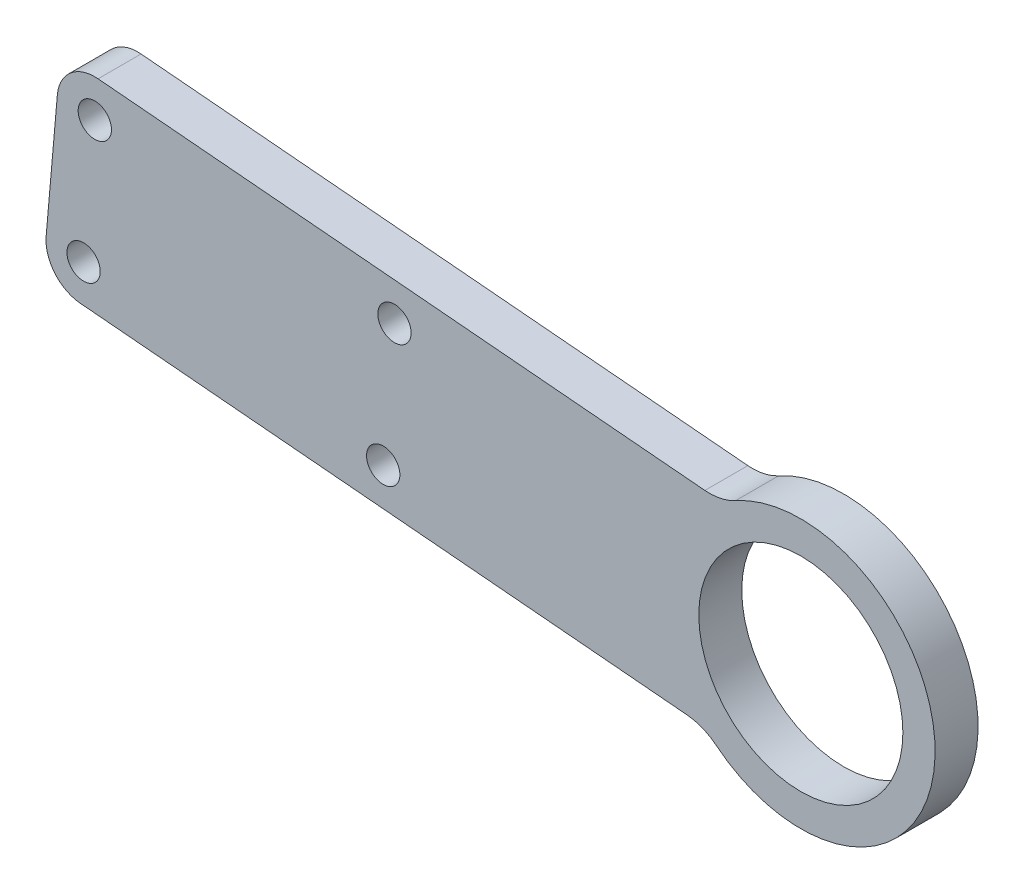
ISO-10303-21;
HEADER;
FILE_DESCRIPTION(('STEP AP214'),'2;1');
FILE_NAME('part.step','',(''),(''),'','','');
FILE_SCHEMA(('AUTOMOTIVE_DESIGN { 1 0 10303 214 1 1 1 1 }'));
ENDSEC;
DATA;
#1=APPLICATION_CONTEXT('core data for automotive mechanical design processes');
#2=APPLICATION_PROTOCOL_DEFINITION('international standard','automotive_design',2000,#1);
#3=PRODUCT_CONTEXT('',#1,'mechanical');
#4=PRODUCT('Part','Part','',(#3));
#5=PRODUCT_RELATED_PRODUCT_CATEGORY('part','',(#4));
#6=PRODUCT_DEFINITION_FORMATION('','',#4);
#7=PRODUCT_DEFINITION_CONTEXT('part definition',#1,'design');
#8=PRODUCT_DEFINITION('design','',#6,#7);
#9=PRODUCT_DEFINITION_SHAPE('','',#8);
#10=(LENGTH_UNIT() NAMED_UNIT(*) SI_UNIT(.MILLI.,.METRE.));
#11=(NAMED_UNIT(*) PLANE_ANGLE_UNIT() SI_UNIT($,.RADIAN.));
#12=(NAMED_UNIT(*) SI_UNIT($,.STERADIAN.) SOLID_ANGLE_UNIT());
#13=UNCERTAINTY_MEASURE_WITH_UNIT(LENGTH_MEASURE(1.E-05),#10,'distance_accuracy_value','');
#14=(GEOMETRIC_REPRESENTATION_CONTEXT(3) GLOBAL_UNCERTAINTY_ASSIGNED_CONTEXT((#13)) GLOBAL_UNIT_ASSIGNED_CONTEXT((#10,
#11,#12)) REPRESENTATION_CONTEXT('',''));
#15=CARTESIAN_POINT('',(0.,0.,0.));
#16=DIRECTION('',(0.,0.,1.));
#17=DIRECTION('',(1.,0.,0.));
#18=AXIS2_PLACEMENT_3D('',#15,#16,#17);
#19=CARTESIAN_POINT('',(0.,0.,2.));
#20=DIRECTION('',(0.,0.,1.));
#21=DIRECTION('',(1.,0.,0.));
#22=AXIS2_PLACEMENT_3D('',#19,#20,#21);
#23=PLANE('',#22);
#24=CARTESIAN_POINT('',(160.,0.,2.));
#25=DIRECTION('',(0.,0.,1.));
#26=DIRECTION('',(1.,0.,0.));
#27=AXIS2_PLACEMENT_3D('',#24,#25,#26);
#28=CIRCLE('',#27,9.50000000000001);
#29=CARTESIAN_POINT('',(169.5,0.,2.));
#30=VERTEX_POINT('',#29);
#31=EDGE_CURVE('E353',#30,#30,#28,.T.);
#32=ORIENTED_EDGE('',*,*,#31,.F.);
#33=EDGE_LOOP('',(#32));
#34=FACE_BOUND('',#33,.T.);
#35=DIRECTION('',(0.996194698091746,-0.0871557427476583,0.));
#36=VECTOR('',#35,1.);
#37=CARTESIAN_POINT('',(11.3715785534696,3.46701349766295,2.));
#38=LINE('',#37,#36);
#39=CARTESIAN_POINT('',(92.9250730207962,-3.66799273915231,2.));
#40=VERTEX_POINT('',#39);
#41=CARTESIAN_POINT('',(149.411345664734,-8.60990124033144,2.));
#42=VERTEX_POINT('',#41);
#43=EDGE_CURVE('E126',#40,#42,#38,.T.);
#44=ORIENTED_EDGE('',*,*,#43,.T.);
#45=CARTESIAN_POINT('',(148.975566950996,-13.5908747307902,2.));
#46=DIRECTION('',(0.,0.,1.));
#47=DIRECTION('',(1.,0.,0.));
#48=AXIS2_PLACEMENT_3D('',#45,#46,#47);
#49=CIRCLE('',#48,5.);
#50=CARTESIAN_POINT('',(152.125404964997,-9.70776766485012,2.));
#51=VERTEX_POINT('',#50);
#52=EDGE_CURVE('E149',#42,#51,#49,.F.);
#53=ORIENTED_EDGE('',*,*,#52,.T.);
#54=CARTESIAN_POINT('',(160.,0.,2.));
#55=DIRECTION('',(0.,0.,1.));
#56=DIRECTION('',(1.,0.,0.));
#57=AXIS2_PLACEMENT_3D('',#54,#55,#56);
#58=CIRCLE('',#57,12.5);
#59=CARTESIAN_POINT('',(153.930773921913,10.9276939384789,2.));
#60=VERTEX_POINT('',#59);
#61=EDGE_CURVE('E164',#51,#60,#58,.T.);
#62=ORIENTED_EDGE('',*,*,#61,.T.);
#63=CARTESIAN_POINT('',(151.503083490678,15.2987715138705,2.));
#64=DIRECTION('',(0.,0.,1.));
#65=DIRECTION('',(1.,0.,0.));
#66=AXIS2_PLACEMENT_3D('',#63,#64,#65);
#67=CIRCLE('',#66,5.);
#68=CARTESIAN_POINT('',(151.06730477694,10.3177980234117,2.));
#69=VERTEX_POINT('',#68);
#70=EDGE_CURVE('E12',#60,#69,#67,.F.);
#71=ORIENTED_EDGE('',*,*,#70,.T.);
#72=DIRECTION('',(-0.996194698091746,0.0871557427476583,0.));
#73=VECTOR('',#72,1.);
#74=CARTESIAN_POINT('',(-1.49619679974456,23.6653748791911,2.));
#75=LINE('',#74,#73);
#76=CARTESIAN_POINT('',(94.5810321330017,15.2597065245909,2.));
#77=VERTEX_POINT('',#76);
#78=EDGE_CURVE('E102',#69,#77,#75,.T.);
#79=ORIENTED_EDGE('',*,*,#78,.T.);
#80=CARTESIAN_POINT('',(94.2759870333849,11.7730250812698,2.));
#81=DIRECTION('',(0.,0.,1.));
#82=DIRECTION('',(1.,0.,0.));
#83=AXIS2_PLACEMENT_3D('',#80,#81,#82);
#84=CIRCLE('',#83,3.5);
#85=CARTESIAN_POINT('',(90.7893055900638,12.0780701808866,2.));
#86=VERTEX_POINT('',#85);
#87=EDGE_CURVE('E97',#77,#86,#84,.T.);
#88=ORIENTED_EDGE('',*,*,#87,.T.);
#89=DIRECTION('',(-0.0871557427476583,-0.996194698091746,0.));
#90=VECTOR('',#89,1.);
#91=CARTESIAN_POINT('',(91.0943506896806,15.5647516242077,2.));
#92=LINE('',#91,#90);
#93=CARTESIAN_POINT('',(89.7434366770919,0.123733803785607,2.));
#94=VERTEX_POINT('',#93);
#95=EDGE_CURVE('E101',#86,#94,#92,.T.);
#96=ORIENTED_EDGE('',*,*,#95,.T.);
#97=CARTESIAN_POINT('',(93.230118120413,-0.181311295831198,2.));
#98=DIRECTION('',(0.,0.,1.));
#99=DIRECTION('',(1.,0.,0.));
#100=AXIS2_PLACEMENT_3D('',#97,#98,#99);
#101=CIRCLE('',#100,3.5);
#102=EDGE_CURVE('E107',#94,#40,#101,.T.);
#103=ORIENTED_EDGE('',*,*,#102,.T.);
#104=EDGE_LOOP('',(#44,#53,#62,#71,#79,#88,#96,#103));
#105=FACE_BOUND('',#104,.T.);
#106=CARTESIAN_POINT('',(93.230118120413,-0.1813112958312,2.));
#107=DIRECTION('',(0.,0.,1.));
#108=DIRECTION('',(1.,0.,0.));
#109=AXIS2_PLACEMENT_3D('',#106,#107,#108);
#110=CIRCLE('',#109,1.54999999999999);
#111=CARTESIAN_POINT('',(94.780118120413,-0.1813112958312,2.));
#112=VERTEX_POINT('',#111);
#113=EDGE_CURVE('E329',#112,#112,#110,.T.);
#114=ORIENTED_EDGE('',*,*,#113,.F.);
#115=EDGE_LOOP('',(#114));
#116=FACE_BOUND('',#115,.T.);
#117=CARTESIAN_POINT('',(122.169438579954,9.33266428433532,2.));
#118=DIRECTION('',(0.,0.,1.));
#119=DIRECTION('',(1.,0.,0.));
#120=AXIS2_PLACEMENT_3D('',#117,#118,#119);
#121=CIRCLE('',#120,1.54999999999999);
#122=CARTESIAN_POINT('',(123.719438579954,9.33266428433532,2.));
#123=VERTEX_POINT('',#122);
#124=EDGE_CURVE('E341',#123,#123,#121,.T.);
#125=ORIENTED_EDGE('',*,*,#124,.F.);
#126=EDGE_LOOP('',(#125));
#127=FACE_BOUND('',#126,.T.);
#128=CARTESIAN_POINT('',(121.123569666982,-2.62167209276563,2.));
#129=DIRECTION('',(0.,0.,1.));
#130=DIRECTION('',(1.,0.,0.));
#131=AXIS2_PLACEMENT_3D('',#128,#129,#130);
#132=CIRCLE('',#131,1.54999999999999);
#133=CARTESIAN_POINT('',(122.673569666982,-2.62167209276563,2.));
#134=VERTEX_POINT('',#133);
#135=EDGE_CURVE('E163',#134,#134,#132,.T.);
#136=ORIENTED_EDGE('',*,*,#135,.F.);
#137=EDGE_LOOP('',(#136));
#138=FACE_BOUND('',#137,.T.);
#139=CARTESIAN_POINT('',(94.2759870333849,11.7730250812698,2.));
#140=DIRECTION('',(0.,0.,1.));
#141=DIRECTION('',(1.,0.,0.));
#142=AXIS2_PLACEMENT_3D('',#139,#140,#141);
#143=CIRCLE('',#142,1.54999999999999);
#144=CARTESIAN_POINT('',(95.8259870333849,11.7730250812698,2.));
#145=VERTEX_POINT('',#144);
#146=EDGE_CURVE('E174',#145,#145,#143,.T.);
#147=ORIENTED_EDGE('',*,*,#146,.F.);
#148=EDGE_LOOP('',(#147));
#149=FACE_BOUND('',#148,.T.);
#150=ADVANCED_FACE('F34',(#34,#105,#116,#127,#138,#149),#23,.T.);
#151=CARTESIAN_POINT('',(0.,0.,-2.));
#152=DIRECTION('',(0.,0.,1.));
#153=DIRECTION('',(1.,0.,0.));
#154=AXIS2_PLACEMENT_3D('',#151,#152,#153);
#155=PLANE('',#154);
#156=CARTESIAN_POINT('',(160.,0.,-2.));
#157=DIRECTION('',(0.,0.,1.));
#158=DIRECTION('',(1.,0.,0.));
#159=AXIS2_PLACEMENT_3D('',#156,#157,#158);
#160=CIRCLE('',#159,9.50000000000001);
#161=CARTESIAN_POINT('',(169.5,0.,-2.));
#162=VERTEX_POINT('',#161);
#163=EDGE_CURVE('E351',#162,#162,#160,.T.);
#164=ORIENTED_EDGE('',*,*,#163,.T.);
#165=EDGE_LOOP('',(#164));
#166=FACE_BOUND('',#165,.T.);
#167=CARTESIAN_POINT('',(93.230118120413,-0.1813112958312,-2.));
#168=DIRECTION('',(0.,0.,1.));
#169=DIRECTION('',(1.,0.,0.));
#170=AXIS2_PLACEMENT_3D('',#167,#168,#169);
#171=CIRCLE('',#170,1.54999999999999);
#172=CARTESIAN_POINT('',(94.780118120413,-0.1813112958312,-2.));
#173=VERTEX_POINT('',#172);
#174=EDGE_CURVE('E327',#173,#173,#171,.T.);
#175=ORIENTED_EDGE('',*,*,#174,.T.);
#176=EDGE_LOOP('',(#175));
#177=FACE_BOUND('',#176,.T.);
#178=CARTESIAN_POINT('',(122.169438579954,9.33266428433532,-2.));
#179=DIRECTION('',(0.,0.,1.));
#180=DIRECTION('',(1.,0.,0.));
#181=AXIS2_PLACEMENT_3D('',#178,#179,#180);
#182=CIRCLE('',#181,1.54999999999999);
#183=CARTESIAN_POINT('',(123.719438579954,9.33266428433532,-2.));
#184=VERTEX_POINT('',#183);
#185=EDGE_CURVE('E334',#184,#184,#182,.T.);
#186=ORIENTED_EDGE('',*,*,#185,.T.);
#187=EDGE_LOOP('',(#186));
#188=FACE_BOUND('',#187,.T.);
#189=CARTESIAN_POINT('',(121.123569666982,-2.62167209276563,-2.));
#190=DIRECTION('',(0.,0.,1.));
#191=DIRECTION('',(1.,0.,0.));
#192=AXIS2_PLACEMENT_3D('',#189,#190,#191);
#193=CIRCLE('',#192,1.54999999999999);
#194=CARTESIAN_POINT('',(122.673569666982,-2.62167209276563,-2.));
#195=VERTEX_POINT('',#194);
#196=EDGE_CURVE('E343',#195,#195,#193,.T.);
#197=ORIENTED_EDGE('',*,*,#196,.T.);
#198=EDGE_LOOP('',(#197));
#199=FACE_BOUND('',#198,.T.);
#200=CARTESIAN_POINT('',(94.2759870333849,11.7730250812698,-2.));
#201=DIRECTION('',(0.,0.,1.));
#202=DIRECTION('',(1.,0.,0.));
#203=AXIS2_PLACEMENT_3D('',#200,#201,#202);
#204=CIRCLE('',#203,1.54999999999999);
#205=CARTESIAN_POINT('',(95.8259870333849,11.7730250812698,-2.));
#206=VERTEX_POINT('',#205);
#207=EDGE_CURVE('E118',#206,#206,#204,.T.);
#208=ORIENTED_EDGE('',*,*,#207,.T.);
#209=EDGE_LOOP('',(#208));
#210=FACE_BOUND('',#209,.T.);
#211=DIRECTION('',(-0.996194698091746,0.0871557427476583,0.));
#212=VECTOR('',#211,1.);
#213=CARTESIAN_POINT('',(-1.49619679974456,23.6653748791911,-2.));
#214=LINE('',#213,#212);
#215=CARTESIAN_POINT('',(151.06730477694,10.3177980234117,-2.));
#216=VERTEX_POINT('',#215);
#217=CARTESIAN_POINT('',(94.5810321330017,15.2597065245909,-2.));
#218=VERTEX_POINT('',#217);
#219=EDGE_CURVE('E129',#216,#218,#214,.T.);
#220=ORIENTED_EDGE('',*,*,#219,.F.);
#221=CARTESIAN_POINT('',(151.503083490678,15.2987715138705,-2.));
#222=DIRECTION('',(0.,0.,1.));
#223=DIRECTION('',(1.,0.,0.));
#224=AXIS2_PLACEMENT_3D('',#221,#222,#223);
#225=CIRCLE('',#224,5.);
#226=CARTESIAN_POINT('',(153.930773921913,10.9276939384789,-2.));
#227=VERTEX_POINT('',#226);
#228=EDGE_CURVE('E42',#216,#227,#225,.T.);
#229=ORIENTED_EDGE('',*,*,#228,.T.);
#230=CARTESIAN_POINT('',(160.,0.,-2.));
#231=DIRECTION('',(0.,0.,1.));
#232=DIRECTION('',(1.,0.,0.));
#233=AXIS2_PLACEMENT_3D('',#230,#231,#232);
#234=CIRCLE('',#233,12.5);
#235=CARTESIAN_POINT('',(152.125404964997,-9.70776766485012,-2.));
#236=VERTEX_POINT('',#235);
#237=EDGE_CURVE('E157',#236,#227,#234,.T.);
#238=ORIENTED_EDGE('',*,*,#237,.F.);
#239=CARTESIAN_POINT('',(148.975566950996,-13.5908747307902,-2.));
#240=DIRECTION('',(0.,0.,1.));
#241=DIRECTION('',(1.,0.,0.));
#242=AXIS2_PLACEMENT_3D('',#239,#240,#241);
#243=CIRCLE('',#242,5.);
#244=CARTESIAN_POINT('',(149.411345664734,-8.60990124033144,-2.));
#245=VERTEX_POINT('',#244);
#246=EDGE_CURVE('E151',#236,#245,#243,.T.);
#247=ORIENTED_EDGE('',*,*,#246,.T.);
#248=DIRECTION('',(0.996194698091746,-0.0871557427476583,0.));
#249=VECTOR('',#248,1.);
#250=CARTESIAN_POINT('',(11.3715785534696,3.46701349766295,-2.));
#251=LINE('',#250,#249);
#252=CARTESIAN_POINT('',(92.9250730207962,-3.66799273915231,-2.));
#253=VERTEX_POINT('',#252);
#254=EDGE_CURVE('E168',#253,#245,#251,.T.);
#255=ORIENTED_EDGE('',*,*,#254,.F.);
#256=CARTESIAN_POINT('',(93.230118120413,-0.181311295831198,-2.));
#257=DIRECTION('',(0.,0.,1.));
#258=DIRECTION('',(1.,0.,0.));
#259=AXIS2_PLACEMENT_3D('',#256,#257,#258);
#260=CIRCLE('',#259,3.5);
#261=CARTESIAN_POINT('',(89.7434366770919,0.123733803785607,-2.));
#262=VERTEX_POINT('',#261);
#263=EDGE_CURVE('E136',#253,#262,#260,.F.);
#264=ORIENTED_EDGE('',*,*,#263,.T.);
#265=DIRECTION('',(-0.0871557427476583,-0.996194698091746,0.));
#266=VECTOR('',#265,1.);
#267=CARTESIAN_POINT('',(91.0943506896806,15.5647516242077,-2.));
#268=LINE('',#267,#266);
#269=CARTESIAN_POINT('',(90.7893055900638,12.0780701808866,-2.));
#270=VERTEX_POINT('',#269);
#271=EDGE_CURVE('E117',#270,#262,#268,.T.);
#272=ORIENTED_EDGE('',*,*,#271,.F.);
#273=CARTESIAN_POINT('',(94.2759870333849,11.7730250812698,-2.));
#274=DIRECTION('',(0.,0.,1.));
#275=DIRECTION('',(1.,0.,0.));
#276=AXIS2_PLACEMENT_3D('',#273,#274,#275);
#277=CIRCLE('',#276,3.5);
#278=EDGE_CURVE('E123',#270,#218,#277,.F.);
#279=ORIENTED_EDGE('',*,*,#278,.T.);
#280=EDGE_LOOP('',(#220,#229,#238,#247,#255,#264,#272,#279));
#281=FACE_BOUND('',#280,.T.);
#282=ADVANCED_FACE('F156',(#166,#177,#188,#199,#210,#281),#155,.F.);
#283=CARTESIAN_POINT('',(11.3715785534696,3.46701349766295,2.));
#284=DIRECTION('',(0.0871557427476583,0.996194698091746,0.));
#285=DIRECTION('',(-0.996194698091746,0.0871557427476583,0.));
#286=AXIS2_PLACEMENT_3D('',#283,#284,#285);
#287=PLANE('',#286);
#288=ORIENTED_EDGE('',*,*,#254,.T.);
#289=DIRECTION('',(0.,0.,1.));
#290=VECTOR('',#289,1.);
#291=CARTESIAN_POINT('',(149.411345664734,-8.60990124033144,2.));
#292=LINE('',#291,#290);
#293=EDGE_CURVE('E140',#245,#42,#292,.T.);
#294=ORIENTED_EDGE('',*,*,#293,.T.);
#295=ORIENTED_EDGE('',*,*,#43,.F.);
#296=DIRECTION('',(0.,0.,1.));
#297=VECTOR('',#296,1.);
#298=CARTESIAN_POINT('',(92.9250730207962,-3.66799273915231,-2.));
#299=LINE('',#298,#297);
#300=EDGE_CURVE('E133',#40,#253,#299,.F.);
#301=ORIENTED_EDGE('',*,*,#300,.T.);
#302=EDGE_LOOP('',(#288,#294,#295,#301));
#303=FACE_BOUND('',#302,.T.);
#304=ADVANCED_FACE('F180',(#303),#287,.F.);
#305=CARTESIAN_POINT('',(-1.49619679974456,23.6653748791911,2.));
#306=DIRECTION('',(-0.0871557427476583,-0.996194698091746,0.));
#307=DIRECTION('',(0.996194698091746,-0.0871557427476583,0.));
#308=AXIS2_PLACEMENT_3D('',#305,#306,#307);
#309=PLANE('',#308);
#310=ORIENTED_EDGE('',*,*,#78,.F.);
#311=DIRECTION('',(0.,0.,1.));
#312=VECTOR('',#311,1.);
#313=CARTESIAN_POINT('',(151.06730477694,10.3177980234117,2.));
#314=LINE('',#313,#312);
#315=EDGE_CURVE('E147',#69,#216,#314,.F.);
#316=ORIENTED_EDGE('',*,*,#315,.T.);
#317=ORIENTED_EDGE('',*,*,#219,.T.);
#318=DIRECTION('',(0.,0.,1.));
#319=VECTOR('',#318,1.);
#320=CARTESIAN_POINT('',(94.5810321330017,15.2597065245909,2.));
#321=LINE('',#320,#319);
#322=EDGE_CURVE('E138',#218,#77,#321,.T.);
#323=ORIENTED_EDGE('',*,*,#322,.T.);
#324=EDGE_LOOP('',(#310,#316,#317,#323));
#325=FACE_BOUND('',#324,.T.);
#326=ADVANCED_FACE('F167',(#325),#309,.F.);
#327=CARTESIAN_POINT('',(91.0943506896806,15.5647516242077,-2.));
#328=DIRECTION('',(-0.996194698091746,0.0871557427476583,0.));
#329=DIRECTION('',(-0.0871557427476583,-0.996194698091746,0.));
#330=AXIS2_PLACEMENT_3D('',#327,#328,#329);
#331=PLANE('',#330);
#332=ORIENTED_EDGE('',*,*,#271,.T.);
#333=DIRECTION('',(0.,0.,1.));
#334=VECTOR('',#333,1.);
#335=CARTESIAN_POINT('',(89.7434366770919,0.123733803785606,2.));
#336=LINE('',#335,#334);
#337=EDGE_CURVE('E108',#262,#94,#336,.T.);
#338=ORIENTED_EDGE('',*,*,#337,.T.);
#339=ORIENTED_EDGE('',*,*,#95,.F.);
#340=DIRECTION('',(0.,0.,1.));
#341=VECTOR('',#340,1.);
#342=CARTESIAN_POINT('',(90.7893055900638,12.0780701808866,-2.));
#343=LINE('',#342,#341);
#344=EDGE_CURVE('E114',#86,#270,#343,.F.);
#345=ORIENTED_EDGE('',*,*,#344,.T.);
#346=EDGE_LOOP('',(#332,#338,#339,#345));
#347=FACE_BOUND('',#346,.T.);
#348=ADVANCED_FACE('F113',(#347),#331,.T.);
#349=CARTESIAN_POINT('',(94.2759870333849,11.7730250812698,-2.));
#350=DIRECTION('',(0.,0.,1.));
#351=DIRECTION('',(1.,0.,0.));
#352=AXIS2_PLACEMENT_3D('',#349,#350,#351);
#353=CYLINDRICAL_SURFACE('',#352,1.54999999999999);
#354=ORIENTED_EDGE('',*,*,#207,.F.);
#355=EDGE_LOOP('',(#354));
#356=FACE_BOUND('',#355,.T.);
#357=ORIENTED_EDGE('',*,*,#146,.T.);
#358=EDGE_LOOP('',(#357));
#359=FACE_BOUND('',#358,.T.);
#360=ADVANCED_FACE('F300',(#356,#359),#353,.F.);
#361=CARTESIAN_POINT('',(121.123569666982,-2.62167209276563,-2.));
#362=DIRECTION('',(0.,0.,1.));
#363=DIRECTION('',(1.,0.,0.));
#364=AXIS2_PLACEMENT_3D('',#361,#362,#363);
#365=CYLINDRICAL_SURFACE('',#364,1.54999999999999);
#366=ORIENTED_EDGE('',*,*,#196,.F.);
#367=EDGE_LOOP('',(#366));
#368=FACE_BOUND('',#367,.T.);
#369=ORIENTED_EDGE('',*,*,#135,.T.);
#370=EDGE_LOOP('',(#369));
#371=FACE_BOUND('',#370,.T.);
#372=ADVANCED_FACE('F291',(#368,#371),#365,.F.);
#373=CARTESIAN_POINT('',(122.169438579954,9.33266428433532,-2.));
#374=DIRECTION('',(0.,0.,1.));
#375=DIRECTION('',(1.,0.,0.));
#376=AXIS2_PLACEMENT_3D('',#373,#374,#375);
#377=CYLINDRICAL_SURFACE('',#376,1.54999999999999);
#378=ORIENTED_EDGE('',*,*,#185,.F.);
#379=EDGE_LOOP('',(#378));
#380=FACE_BOUND('',#379,.T.);
#381=ORIENTED_EDGE('',*,*,#124,.T.);
#382=EDGE_LOOP('',(#381));
#383=FACE_BOUND('',#382,.T.);
#384=ADVANCED_FACE('F192',(#380,#383),#377,.F.);
#385=CARTESIAN_POINT('',(93.230118120413,-0.1813112958312,-2.));
#386=DIRECTION('',(0.,0.,1.));
#387=DIRECTION('',(1.,0.,0.));
#388=AXIS2_PLACEMENT_3D('',#385,#386,#387);
#389=CYLINDRICAL_SURFACE('',#388,1.54999999999999);
#390=ORIENTED_EDGE('',*,*,#174,.F.);
#391=EDGE_LOOP('',(#390));
#392=FACE_BOUND('',#391,.T.);
#393=ORIENTED_EDGE('',*,*,#113,.T.);
#394=EDGE_LOOP('',(#393));
#395=FACE_BOUND('',#394,.T.);
#396=ADVANCED_FACE('F185',(#392,#395),#389,.F.);
#397=CARTESIAN_POINT('',(93.230118120413,-0.181311295831198,-2.));
#398=DIRECTION('',(0.,0.,-1.));
#399=DIRECTION('',(-1.,0.,0.));
#400=AXIS2_PLACEMENT_3D('',#397,#398,#399);
#401=CYLINDRICAL_SURFACE('',#400,3.5);
#402=ORIENTED_EDGE('',*,*,#263,.F.);
#403=ORIENTED_EDGE('',*,*,#300,.F.);
#404=ORIENTED_EDGE('',*,*,#102,.F.);
#405=ORIENTED_EDGE('',*,*,#337,.F.);
#406=EDGE_LOOP('',(#402,#403,#404,#405));
#407=FACE_BOUND('',#406,.T.);
#408=ADVANCED_FACE('F183',(#407),#401,.T.);
#409=CARTESIAN_POINT('',(94.2759870333849,11.7730250812698,2.));
#410=DIRECTION('',(0.,0.,-1.));
#411=DIRECTION('',(-1.,0.,0.));
#412=AXIS2_PLACEMENT_3D('',#409,#410,#411);
#413=CYLINDRICAL_SURFACE('',#412,3.5);
#414=ORIENTED_EDGE('',*,*,#278,.F.);
#415=ORIENTED_EDGE('',*,*,#344,.F.);
#416=ORIENTED_EDGE('',*,*,#87,.F.);
#417=ORIENTED_EDGE('',*,*,#322,.F.);
#418=EDGE_LOOP('',(#414,#415,#416,#417));
#419=FACE_BOUND('',#418,.T.);
#420=ADVANCED_FACE('F121',(#419),#413,.T.);
#421=CARTESIAN_POINT('',(160.,0.,-2.));
#422=DIRECTION('',(0.,0.,1.));
#423=DIRECTION('',(1.,0.,0.));
#424=AXIS2_PLACEMENT_3D('',#421,#422,#423);
#425=CYLINDRICAL_SURFACE('',#424,12.5);
#426=ORIENTED_EDGE('',*,*,#61,.F.);
#427=DIRECTION('',(0.,0.,1.));
#428=VECTOR('',#427,1.);
#429=CARTESIAN_POINT('',(152.125404964997,-9.70776766485012,-2.));
#430=LINE('',#429,#428);
#431=EDGE_CURVE('E145',#51,#236,#430,.F.);
#432=ORIENTED_EDGE('',*,*,#431,.T.);
#433=ORIENTED_EDGE('',*,*,#237,.T.);
#434=DIRECTION('',(0.,0.,1.));
#435=VECTOR('',#434,1.);
#436=CARTESIAN_POINT('',(153.930773921913,10.9276939384789,-2.));
#437=LINE('',#436,#435);
#438=EDGE_CURVE('E143',#227,#60,#437,.T.);
#439=ORIENTED_EDGE('',*,*,#438,.T.);
#440=EDGE_LOOP('',(#426,#432,#433,#439));
#441=FACE_BOUND('',#440,.T.);
#442=ADVANCED_FACE('F161',(#441),#425,.T.);
#443=CARTESIAN_POINT('',(160.,0.,-2.));
#444=DIRECTION('',(0.,0.,1.));
#445=DIRECTION('',(1.,0.,0.));
#446=AXIS2_PLACEMENT_3D('',#443,#444,#445);
#447=CYLINDRICAL_SURFACE('',#446,9.50000000000001);
#448=ORIENTED_EDGE('',*,*,#163,.F.);
#449=EDGE_LOOP('',(#448));
#450=FACE_BOUND('',#449,.T.);
#451=ORIENTED_EDGE('',*,*,#31,.T.);
#452=EDGE_LOOP('',(#451));
#453=FACE_BOUND('',#452,.T.);
#454=ADVANCED_FACE('F229',(#450,#453),#447,.F.);
#455=CARTESIAN_POINT('',(148.975566950996,-13.5908747307902,-2.));
#456=DIRECTION('',(0.,0.,1.));
#457=DIRECTION('',(1.,0.,0.));
#458=AXIS2_PLACEMENT_3D('',#455,#456,#457);
#459=CYLINDRICAL_SURFACE('',#458,5.);
#460=ORIENTED_EDGE('',*,*,#246,.F.);
#461=ORIENTED_EDGE('',*,*,#431,.F.);
#462=ORIENTED_EDGE('',*,*,#52,.F.);
#463=ORIENTED_EDGE('',*,*,#293,.F.);
#464=EDGE_LOOP('',(#460,#461,#462,#463));
#465=FACE_BOUND('',#464,.T.);
#466=ADVANCED_FACE('F236',(#465),#459,.F.);
#467=CARTESIAN_POINT('',(151.503083490678,15.2987715138705,-2.));
#468=DIRECTION('',(0.,0.,1.));
#469=DIRECTION('',(1.,0.,0.));
#470=AXIS2_PLACEMENT_3D('',#467,#468,#469);
#471=CYLINDRICAL_SURFACE('',#470,5.);
#472=ORIENTED_EDGE('',*,*,#70,.F.);
#473=ORIENTED_EDGE('',*,*,#438,.F.);
#474=ORIENTED_EDGE('',*,*,#228,.F.);
#475=ORIENTED_EDGE('',*,*,#315,.F.);
#476=EDGE_LOOP('',(#472,#473,#474,#475));
#477=FACE_BOUND('',#476,.T.);
#478=ADVANCED_FACE('F36',(#477),#471,.F.);
#479=CLOSED_SHELL('',(#150,#282,#304,#326,#348,#360,#372,#384,#396,#408,#420,#442,#454,#466,#478));
#480=MANIFOLD_SOLID_BREP('B2',#479);
#481=ADVANCED_BREP_SHAPE_REPRESENTATION('',(#18,#480),#14);
#482=SHAPE_DEFINITION_REPRESENTATION(#9,#481);
ENDSEC;
END-ISO-10303-21;
